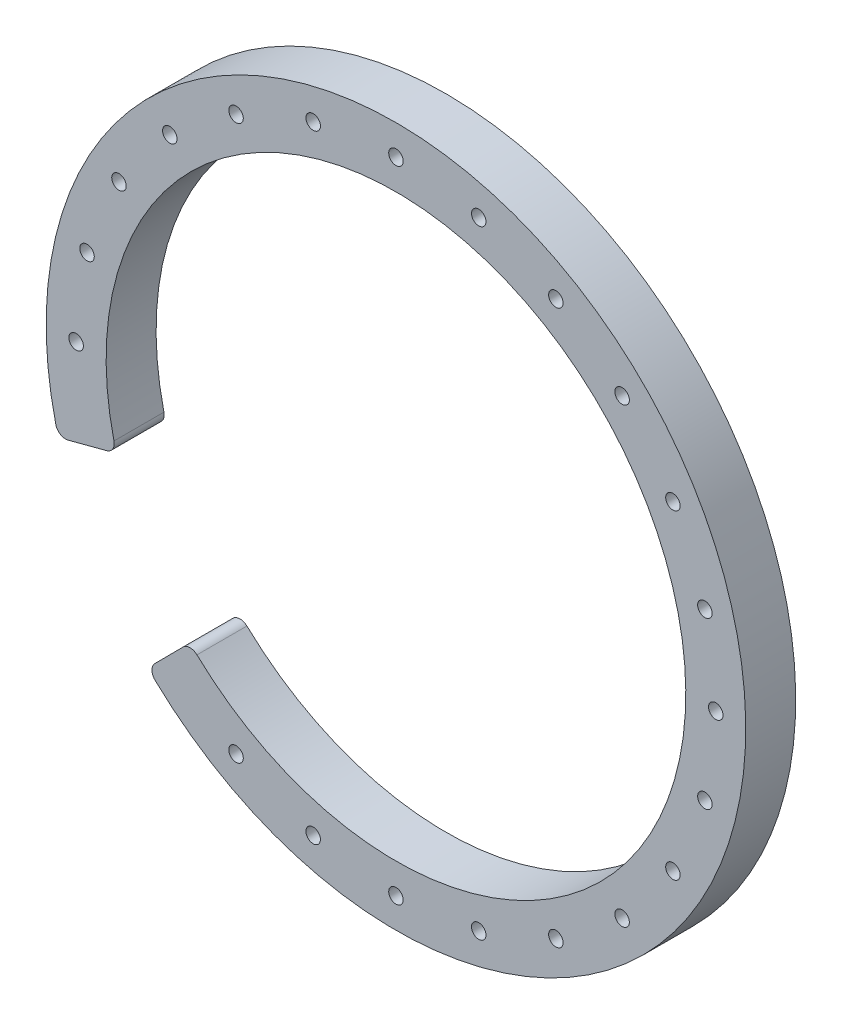
ISO-10303-21;
HEADER;
FILE_DESCRIPTION(('STEP AP214'),'2;1');
FILE_NAME('part.step','',(''),(''),'','','');
FILE_SCHEMA(('AUTOMOTIVE_DESIGN { 1 0 10303 214 1 1 1 1 }'));
ENDSEC;
DATA;
#1=APPLICATION_CONTEXT('core data for automotive mechanical design processes');
#2=APPLICATION_PROTOCOL_DEFINITION('international standard','automotive_design',2000,#1);
#3=PRODUCT_CONTEXT('',#1,'mechanical');
#4=PRODUCT('Part','Part','',(#3));
#5=PRODUCT_RELATED_PRODUCT_CATEGORY('part','',(#4));
#6=PRODUCT_DEFINITION_FORMATION('','',#4);
#7=PRODUCT_DEFINITION_CONTEXT('part definition',#1,'design');
#8=PRODUCT_DEFINITION('design','',#6,#7);
#9=PRODUCT_DEFINITION_SHAPE('','',#8);
#10=(LENGTH_UNIT() NAMED_UNIT(*) SI_UNIT(.MILLI.,.METRE.));
#11=(NAMED_UNIT(*) PLANE_ANGLE_UNIT() SI_UNIT($,.RADIAN.));
#12=(NAMED_UNIT(*) SI_UNIT($,.STERADIAN.) SOLID_ANGLE_UNIT());
#13=UNCERTAINTY_MEASURE_WITH_UNIT(LENGTH_MEASURE(1.E-05),#10,'distance_accuracy_value','');
#14=(GEOMETRIC_REPRESENTATION_CONTEXT(3) GLOBAL_UNCERTAINTY_ASSIGNED_CONTEXT((#13)) GLOBAL_UNIT_ASSIGNED_CONTEXT((#10,
#11,#12)) REPRESENTATION_CONTEXT('',''));
#15=CARTESIAN_POINT('',(0.,0.,0.));
#16=DIRECTION('',(0.,0.,1.));
#17=DIRECTION('',(1.,0.,0.));
#18=AXIS2_PLACEMENT_3D('',#15,#16,#17);
#19=CARTESIAN_POINT('',(-21.4655217337208,0.301986573379911,10.));
#20=DIRECTION('',(0.,0.,-1.));
#21=DIRECTION('',(-1.,0.,0.));
#22=AXIS2_PLACEMENT_3D('',#19,#20,#21);
#23=PLANE('',#22);
#24=CARTESIAN_POINT('',(106.466365988527,32.7761356443503,10.));
#25=DIRECTION('',(0.,0.,1.));
#26=DIRECTION('',(1.,0.,0.));
#27=AXIS2_PLACEMENT_3D('',#24,#25,#26);
#28=CIRCLE('',#27,1.45000000068001);
#29=CARTESIAN_POINT('',(107.916365989207,32.7761356443503,10.));
#30=VERTEX_POINT('',#29);
#31=EDGE_CURVE('E290',#30,#30,#28,.T.);
#32=ORIENTED_EDGE('',*,*,#31,.F.);
#33=EDGE_LOOP('',(#32));
#34=FACE_BOUND('',#33,.T.);
#35=CARTESIAN_POINT('',(89.9019471021725,61.466550752391,10.));
#36=DIRECTION('',(0.,0.,1.));
#37=DIRECTION('',(1.,0.,0.));
#38=AXIS2_PLACEMENT_3D('',#35,#36,#37);
#39=CIRCLE('',#38,1.45000000068001);
#40=CARTESIAN_POINT('',(91.3519471028525,61.466550752391,10.));
#41=VERTEX_POINT('',#40);
#42=EDGE_CURVE('E278',#41,#41,#39,.T.);
#43=ORIENTED_EDGE('',*,*,#42,.F.);
#44=EDGE_LOOP('',(#43));
#45=FACE_BOUND('',#44,.T.);
#46=CARTESIAN_POINT('',(61.2115319920066,78.0309696390124,10.));
#47=DIRECTION('',(0.,0.,1.));
#48=DIRECTION('',(1.,0.,0.));
#49=AXIS2_PLACEMENT_3D('',#46,#47,#48);
#50=CIRCLE('',#49,1.45000000068002);
#51=CARTESIAN_POINT('',(62.6615319926866,78.0309696390124,10.));
#52=VERTEX_POINT('',#51);
#53=EDGE_CURVE('E266',#52,#52,#50,.T.);
#54=ORIENTED_EDGE('',*,*,#53,.F.);
#55=EDGE_LOOP('',(#54));
#56=FACE_BOUND('',#55,.T.);
#57=CARTESIAN_POINT('',(28.0826942196036,78.0309696386723,10.));
#58=DIRECTION('',(0.,0.,1.));
#59=DIRECTION('',(1.,0.,0.));
#60=AXIS2_PLACEMENT_3D('',#57,#58,#59);
#61=CIRCLE('',#60,1.45000000067999);
#62=CARTESIAN_POINT('',(29.5326942202836,78.0309696386723,10.));
#63=VERTEX_POINT('',#62);
#64=EDGE_CURVE('E254',#63,#63,#61,.T.);
#65=ORIENTED_EDGE('',*,*,#64,.F.);
#66=EDGE_LOOP('',(#65));
#67=FACE_BOUND('',#66,.T.);
#68=CARTESIAN_POINT('',(-0.607720888874778,61.4665507528091,10.));
#69=DIRECTION('',(0.,0.,1.));
#70=DIRECTION('',(1.,0.,0.));
#71=AXIS2_PLACEMENT_3D('',#68,#69,#70);
#72=CIRCLE('',#71,1.45000000067999);
#73=CARTESIAN_POINT('',(0.842279111805213,61.4665507528091,10.));
#74=VERTEX_POINT('',#73);
#75=EDGE_CURVE('E242',#74,#74,#72,.T.);
#76=ORIENTED_EDGE('',*,*,#75,.F.);
#77=EDGE_LOOP('',(#76));
#78=FACE_BOUND('',#77,.T.);
#79=CARTESIAN_POINT('',(28.082694218639,-45.6075361259227,10.));
#80=DIRECTION('',(0.,0.,1.));
#81=DIRECTION('',(1.,0.,0.));
#82=AXIS2_PLACEMENT_3D('',#79,#80,#81);
#83=CIRCLE('',#82,1.45000000067999);
#84=CARTESIAN_POINT('',(29.532694219319,-45.6075361259227,10.));
#85=VERTEX_POINT('',#84);
#86=EDGE_CURVE('E230',#85,#85,#83,.T.);
#87=ORIENTED_EDGE('',*,*,#86,.F.);
#88=EDGE_LOOP('',(#87));
#89=FACE_BOUND('',#88,.T.);
#90=CARTESIAN_POINT('',(61.2115319929712,-45.6075361262628,10.));
#91=DIRECTION('',(0.,0.,1.));
#92=DIRECTION('',(1.,0.,0.));
#93=AXIS2_PLACEMENT_3D('',#90,#91,#92);
#94=CIRCLE('',#93,1.45000000068001);
#95=CARTESIAN_POINT('',(62.6615319936513,-45.6075361262628,10.));
#96=VERTEX_POINT('',#95);
#97=EDGE_CURVE('E218',#96,#96,#94,.T.);
#98=ORIENTED_EDGE('',*,*,#97,.F.);
#99=EDGE_LOOP('',(#98));
#100=FACE_BOUND('',#99,.T.);
#101=CARTESIAN_POINT('',(89.9019471041017,-29.0431172379706,10.));
#102=DIRECTION('',(0.,0.,1.));
#103=DIRECTION('',(1.,0.,0.));
#104=AXIS2_PLACEMENT_3D('',#101,#102,#103);
#105=CIRCLE('',#104,1.45000000068001);
#106=CARTESIAN_POINT('',(91.3519471047817,-29.0431172379706,10.));
#107=VERTEX_POINT('',#106);
#108=EDGE_CURVE('E206',#107,#107,#105,.T.);
#109=ORIENTED_EDGE('',*,*,#108,.F.);
#110=EDGE_LOOP('',(#109));
#111=FACE_BOUND('',#110,.T.);
#112=CARTESIAN_POINT('',(106.466365989491,-0.352702128259125,10.));
#113=DIRECTION('',(0.,0.,1.));
#114=DIRECTION('',(1.,0.,0.));
#115=AXIS2_PLACEMENT_3D('',#112,#113,#114);
#116=CIRCLE('',#115,1.45000000068001);
#117=CARTESIAN_POINT('',(107.916365990171,-0.352702128259125,10.));
#118=VERTEX_POINT('',#117);
#119=EDGE_CURVE('E194',#118,#118,#116,.T.);
#120=ORIENTED_EDGE('',*,*,#119,.F.);
#121=EDGE_LOOP('',(#120));
#122=FACE_BOUND('',#121,.T.);
#123=CARTESIAN_POINT('',(-10.7785127349104,48.2117167577246,10.));
#124=DIRECTION('',(0.,0.,1.));
#125=DIRECTION('',(1.,0.,0.));
#126=AXIS2_PLACEMENT_3D('',#123,#124,#125);
#127=CIRCLE('',#126,1.45000000067999);
#128=CARTESIAN_POINT('',(-9.32851273423041,48.2117167577246,10.));
#129=VERTEX_POINT('',#128);
#130=EDGE_CURVE('E182',#129,#129,#127,.T.);
#131=ORIENTED_EDGE('',*,*,#130,.F.);
#132=EDGE_LOOP('',(#131));
#133=FACE_BOUND('',#132,.T.);
#134=CARTESIAN_POINT('',(-21.4655217337208,0.301986573379911,10.));
#135=DIRECTION('',(0.,0.,1.));
#136=DIRECTION('',(-1.,0.,0.));
#137=AXIS2_PLACEMENT_3D('',#134,#135,#136);
#138=CIRCLE('',#137,2.);
#139=CARTESIAN_POINT('',(-23.4100109937255,-0.165946667292641,10.));
#140=VERTEX_POINT('',#139);
#141=CARTESIAN_POINT('',(-20.9549615565254,-1.63174771691497,10.));
#142=VERTEX_POINT('',#141);
#143=EDGE_CURVE('E145',#140,#142,#138,.T.);
#144=ORIENTED_EDGE('',*,*,#143,.T.);
#145=DIRECTION('',(0.966867145147441,0.255280088597674,0.));
#146=VECTOR('',#145,1.);
#147=CARTESIAN_POINT('',(-17.1055653612271,-0.615398979950219,10.));
#148=LINE('',#147,#146);
#149=CARTESIAN_POINT('',(-13.2179059297805,0.411052326289917,10.));
#150=VERTEX_POINT('',#149);
#151=EDGE_CURVE('E93',#142,#150,#148,.T.);
#152=ORIENTED_EDGE('',*,*,#151,.T.);
#153=CARTESIAN_POINT('',(-13.7284661069758,2.3447866165848,10.));
#154=DIRECTION('',(0.,0.,1.));
#155=DIRECTION('',(-1.,0.,0.));
#156=AXIS2_PLACEMENT_3D('',#153,#154,#155);
#157=CIRCLE('',#156,2.);
#158=CARTESIAN_POINT('',(-11.7826134665287,2.80701762124016,10.));
#159=VERTEX_POINT('',#158);
#160=EDGE_CURVE('E160',#150,#159,#157,.T.);
#161=ORIENTED_EDGE('',*,*,#160,.T.);
#162=CARTESIAN_POINT('',(44.6471131064398,16.2117167562456,10.));
#163=DIRECTION('',(0.,0.,-1.));
#164=DIRECTION('',(1.,0.,0.));
#165=AXIS2_PLACEMENT_3D('',#162,#163,#164);
#166=CIRCLE('',#165,58.);
#167=CARTESIAN_POINT('',(4.82343983769334,-25.955510415862,10.));
#168=VERTEX_POINT('',#167);
#169=EDGE_CURVE('E173',#159,#168,#166,.T.);
#170=ORIENTED_EDGE('',*,*,#169,.T.);
#171=CARTESIAN_POINT('',(3.45020972497796,-27.4095527321416,10.));
#172=DIRECTION('',(0.,0.,1.));
#173=DIRECTION('',(1.,0.,0.));
#174=AXIS2_PLACEMENT_3D('',#171,#172,#173);
#175=CIRCLE('',#174,2.);
#176=CARTESIAN_POINT('',(2.0308267940533,-26.0005275033398,10.));
#177=VERTEX_POINT('',#176);
#178=EDGE_CURVE('E112',#168,#177,#175,.T.);
#179=ORIENTED_EDGE('',*,*,#178,.T.);
#180=DIRECTION('',(-0.704512614400858,-0.709691465462329,0.));
#181=VECTOR('',#180,1.);
#182=CARTESIAN_POINT('',(2.0308267940533,-26.0005275033398,10.));
#183=LINE('',#182,#181);
#184=CARTESIAN_POINT('',(-3.60681775175627,-31.6796142048234,10.));
#185=VERTEX_POINT('',#184);
#186=EDGE_CURVE('E106',#177,#185,#183,.T.);
#187=ORIENTED_EDGE('',*,*,#186,.T.);
#188=CARTESIAN_POINT('',(-2.18743482083161,-33.0886394336251,10.));
#189=DIRECTION('',(0.,0.,1.));
#190=DIRECTION('',(1.,0.,0.));
#191=AXIS2_PLACEMENT_3D('',#188,#189,#190);
#192=CIRCLE('',#191,2.);
#193=CARTESIAN_POINT('',(-3.56492152457489,-34.5386499097977,10.));
#194=VERTEX_POINT('',#193);
#195=EDGE_CURVE('E110',#185,#194,#192,.T.);
#196=ORIENTED_EDGE('',*,*,#195,.T.);
#197=CARTESIAN_POINT('',(44.6471131064398,16.2117167562456,10.));
#198=DIRECTION('',(0.,0.,1.));
#199=DIRECTION('',(1.,0.,0.));
#200=AXIS2_PLACEMENT_3D('',#197,#198,#199);
#201=CIRCLE('',#200,70.);
#202=EDGE_CURVE('E50',#194,#140,#201,.T.);
#203=ORIENTED_EDGE('',*,*,#202,.T.);
#204=EDGE_LOOP('',(#144,#152,#161,#170,#179,#187,#196,#203));
#205=FACE_BOUND('',#204,.T.);
#206=CARTESIAN_POINT('',(-17.172139775591,32.7761356445594,10.));
#207=DIRECTION('',(0.,0.,1.));
#208=DIRECTION('',(1.,0.,0.));
#209=AXIS2_PLACEMENT_3D('',#206,#207,#208);
#210=CIRCLE('',#209,1.45000000067999);
#211=CARTESIAN_POINT('',(-15.722139774911,32.7761356445594,10.));
#212=VERTEX_POINT('',#211);
#213=EDGE_CURVE('E133',#212,#212,#210,.T.);
#214=ORIENTED_EDGE('',*,*,#213,.F.);
#215=EDGE_LOOP('',(#214));
#216=FACE_BOUND('',#215,.T.);
#217=CARTESIAN_POINT('',(-19.3528868935602,16.2117167581749,10.));
#218=DIRECTION('',(0.,0.,1.));
#219=DIRECTION('',(1.,0.,0.));
#220=AXIS2_PLACEMENT_3D('',#217,#218,#219);
#221=CIRCLE('',#220,1.45000000067999);
#222=CARTESIAN_POINT('',(-17.9028868928802,16.2117167581749,10.));
#223=VERTEX_POINT('',#222);
#224=EDGE_CURVE('E188',#223,#223,#221,.T.);
#225=ORIENTED_EDGE('',*,*,#224,.F.);
#226=EDGE_LOOP('',(#225));
#227=FACE_BOUND('',#226,.T.);
#228=CARTESIAN_POINT('',(100.07273894967,-15.7882832419774,10.));
#229=DIRECTION('',(0.,0.,1.));
#230=DIRECTION('',(1.,0.,0.));
#231=AXIS2_PLACEMENT_3D('',#228,#229,#230);
#232=CIRCLE('',#231,1.45000000068001);
#233=CARTESIAN_POINT('',(101.52273895035,-15.7882832419774,10.));
#234=VERTEX_POINT('',#233);
#235=EDGE_CURVE('E200',#234,#234,#232,.T.);
#236=ORIENTED_EDGE('',*,*,#235,.F.);
#237=EDGE_LOOP('',(#236));
#238=FACE_BOUND('',#237,.T.);
#239=CARTESIAN_POINT('',(76.6471131070915,-39.2139090855822,10.));
#240=DIRECTION('',(0.,0.,1.));
#241=DIRECTION('',(1.,0.,0.));
#242=AXIS2_PLACEMENT_3D('',#239,#240,#241);
#243=CIRCLE('',#242,1.45000000068001);
#244=CARTESIAN_POINT('',(78.0971131077715,-39.2139090855822,10.));
#245=VERTEX_POINT('',#244);
#246=EDGE_CURVE('E212',#245,#245,#243,.T.);
#247=ORIENTED_EDGE('',*,*,#246,.F.);
#248=EDGE_LOOP('',(#247));
#249=FACE_BOUND('',#248,.T.);
#250=CARTESIAN_POINT('',(44.6471131057595,-47.7882832437544,10.));
#251=DIRECTION('',(0.,0.,1.));
#252=DIRECTION('',(1.,0.,0.));
#253=AXIS2_PLACEMENT_3D('',#250,#251,#252);
#254=CIRCLE('',#253,1.45000000068002);
#255=CARTESIAN_POINT('',(46.0971131064395,-47.7882832437544,10.));
#256=VERTEX_POINT('',#255);
#257=EDGE_CURVE('E224',#256,#256,#254,.T.);
#258=ORIENTED_EDGE('',*,*,#257,.F.);
#259=EDGE_LOOP('',(#258));
#260=FACE_BOUND('',#259,.T.);
#261=CARTESIAN_POINT('',(12.6471131064152,-39.2139090859443,10.));
#262=DIRECTION('',(0.,0.,1.));
#263=DIRECTION('',(1.,0.,0.));
#264=AXIS2_PLACEMENT_3D('',#261,#262,#263);
#265=CIRCLE('',#264,1.45000000067999);
#266=CARTESIAN_POINT('',(14.0971131070952,-39.2139090859443,10.));
#267=VERTEX_POINT('',#266);
#268=EDGE_CURVE('E236',#267,#267,#265,.T.);
#269=ORIENTED_EDGE('',*,*,#268,.F.);
#270=EDGE_LOOP('',(#269));
#271=FACE_BOUND('',#270,.T.);
#272=CARTESIAN_POINT('',(12.647113108086,71.6373425994001,10.));
#273=DIRECTION('',(0.,0.,1.));
#274=DIRECTION('',(1.,0.,0.));
#275=AXIS2_PLACEMENT_3D('',#272,#273,#274);
#276=CIRCLE('',#275,1.45000000067999);
#277=CARTESIAN_POINT('',(14.097113108766,71.6373425994001,10.));
#278=VERTEX_POINT('',#277);
#279=EDGE_CURVE('E248',#278,#278,#276,.T.);
#280=ORIENTED_EDGE('',*,*,#279,.F.);
#281=EDGE_LOOP('',(#280));
#282=FACE_BOUND('',#281,.T.);
#283=CARTESIAN_POINT('',(44.6471131057595,80.2117167562456,10.));
#284=DIRECTION('',(0.,0.,1.));
#285=DIRECTION('',(1.,0.,0.));
#286=AXIS2_PLACEMENT_3D('',#283,#284,#285);
#287=CIRCLE('',#286,1.45000000068002);
#288=CARTESIAN_POINT('',(46.0971131064395,80.2117167562456,10.));
#289=VERTEX_POINT('',#288);
#290=EDGE_CURVE('E260',#289,#289,#287,.T.);
#291=ORIENTED_EDGE('',*,*,#290,.F.);
#292=EDGE_LOOP('',(#291));
#293=FACE_BOUND('',#292,.T.);
#294=CARTESIAN_POINT('',(76.6471131054207,71.637342599038,10.));
#295=DIRECTION('',(0.,0.,1.));
#296=DIRECTION('',(1.,0.,0.));
#297=AXIS2_PLACEMENT_3D('',#294,#295,#296);
#298=CIRCLE('',#297,1.45000000068001);
#299=CARTESIAN_POINT('',(78.0971131061007,71.637342599038,10.));
#300=VERTEX_POINT('',#299);
#301=EDGE_CURVE('E272',#300,#300,#298,.T.);
#302=ORIENTED_EDGE('',*,*,#301,.F.);
#303=EDGE_LOOP('',(#302));
#304=FACE_BOUND('',#303,.T.);
#305=CARTESIAN_POINT('',(100.072738947999,48.2117167573625,10.));
#306=DIRECTION('',(0.,0.,1.));
#307=DIRECTION('',(1.,0.,0.));
#308=AXIS2_PLACEMENT_3D('',#305,#306,#307);
#309=CIRCLE('',#308,1.45000000068001);
#310=CARTESIAN_POINT('',(101.522738948679,48.2117167573625,10.));
#311=VERTEX_POINT('',#310);
#312=EDGE_CURVE('E284',#311,#311,#309,.T.);
#313=ORIENTED_EDGE('',*,*,#312,.F.);
#314=EDGE_LOOP('',(#313));
#315=FACE_BOUND('',#314,.T.);
#316=CARTESIAN_POINT('',(108.64711310644,16.2117167581749,10.));
#317=DIRECTION('',(0.,0.,1.));
#318=DIRECTION('',(1.,0.,0.));
#319=AXIS2_PLACEMENT_3D('',#316,#317,#318);
#320=CIRCLE('',#319,1.45000000067997);
#321=CARTESIAN_POINT('',(110.09711310712,16.2117167581749,10.));
#322=VERTEX_POINT('',#321);
#323=EDGE_CURVE('E296',#322,#322,#320,.T.);
#324=ORIENTED_EDGE('',*,*,#323,.F.);
#325=EDGE_LOOP('',(#324));
#326=FACE_BOUND('',#325,.T.);
#327=ADVANCED_FACE('F33',(#34,#45,#56,#67,#78,#89,#100,#111,#122,#133,#205,#216,#227,#238,#249,
#260,#271,#282,#293,#304,#315,#326),#23,.F.);
#328=CARTESIAN_POINT('',(-21.4655217337208,0.301986573379911,0.));
#329=DIRECTION('',(0.,0.,-1.));
#330=DIRECTION('',(-1.,0.,0.));
#331=AXIS2_PLACEMENT_3D('',#328,#329,#330);
#332=PLANE('',#331);
#333=CARTESIAN_POINT('',(106.466365988527,32.7761356443503,0.));
#334=DIRECTION('',(0.,0.,1.));
#335=DIRECTION('',(1.,0.,0.));
#336=AXIS2_PLACEMENT_3D('',#333,#334,#335);
#337=CIRCLE('',#336,1.45000000068001);
#338=CARTESIAN_POINT('',(107.916365989207,32.7761356443503,0.));
#339=VERTEX_POINT('',#338);
#340=EDGE_CURVE('E293',#339,#339,#337,.T.);
#341=ORIENTED_EDGE('',*,*,#340,.T.);
#342=EDGE_LOOP('',(#341));
#343=FACE_BOUND('',#342,.T.);
#344=CARTESIAN_POINT('',(89.9019471021725,61.466550752391,0.));
#345=DIRECTION('',(0.,0.,1.));
#346=DIRECTION('',(1.,0.,0.));
#347=AXIS2_PLACEMENT_3D('',#344,#345,#346);
#348=CIRCLE('',#347,1.45000000068001);
#349=CARTESIAN_POINT('',(91.3519471028525,61.466550752391,0.));
#350=VERTEX_POINT('',#349);
#351=EDGE_CURVE('E281',#350,#350,#348,.T.);
#352=ORIENTED_EDGE('',*,*,#351,.T.);
#353=EDGE_LOOP('',(#352));
#354=FACE_BOUND('',#353,.T.);
#355=CARTESIAN_POINT('',(61.2115319920066,78.0309696390124,0.));
#356=DIRECTION('',(0.,0.,1.));
#357=DIRECTION('',(1.,0.,0.));
#358=AXIS2_PLACEMENT_3D('',#355,#356,#357);
#359=CIRCLE('',#358,1.45000000068002);
#360=CARTESIAN_POINT('',(62.6615319926866,78.0309696390124,0.));
#361=VERTEX_POINT('',#360);
#362=EDGE_CURVE('E269',#361,#361,#359,.T.);
#363=ORIENTED_EDGE('',*,*,#362,.T.);
#364=EDGE_LOOP('',(#363));
#365=FACE_BOUND('',#364,.T.);
#366=CARTESIAN_POINT('',(28.0826942196036,78.0309696386723,0.));
#367=DIRECTION('',(0.,0.,1.));
#368=DIRECTION('',(1.,0.,0.));
#369=AXIS2_PLACEMENT_3D('',#366,#367,#368);
#370=CIRCLE('',#369,1.45000000067999);
#371=CARTESIAN_POINT('',(29.5326942202836,78.0309696386723,0.));
#372=VERTEX_POINT('',#371);
#373=EDGE_CURVE('E257',#372,#372,#370,.T.);
#374=ORIENTED_EDGE('',*,*,#373,.T.);
#375=EDGE_LOOP('',(#374));
#376=FACE_BOUND('',#375,.T.);
#377=CARTESIAN_POINT('',(-0.607720888874778,61.4665507528091,0.));
#378=DIRECTION('',(0.,0.,1.));
#379=DIRECTION('',(1.,0.,0.));
#380=AXIS2_PLACEMENT_3D('',#377,#378,#379);
#381=CIRCLE('',#380,1.45000000067999);
#382=CARTESIAN_POINT('',(0.842279111805213,61.4665507528091,0.));
#383=VERTEX_POINT('',#382);
#384=EDGE_CURVE('E245',#383,#383,#381,.T.);
#385=ORIENTED_EDGE('',*,*,#384,.T.);
#386=EDGE_LOOP('',(#385));
#387=FACE_BOUND('',#386,.T.);
#388=CARTESIAN_POINT('',(28.082694218639,-45.6075361259227,0.));
#389=DIRECTION('',(0.,0.,1.));
#390=DIRECTION('',(1.,0.,0.));
#391=AXIS2_PLACEMENT_3D('',#388,#389,#390);
#392=CIRCLE('',#391,1.45000000067999);
#393=CARTESIAN_POINT('',(29.532694219319,-45.6075361259227,0.));
#394=VERTEX_POINT('',#393);
#395=EDGE_CURVE('E233',#394,#394,#392,.T.);
#396=ORIENTED_EDGE('',*,*,#395,.T.);
#397=EDGE_LOOP('',(#396));
#398=FACE_BOUND('',#397,.T.);
#399=CARTESIAN_POINT('',(61.2115319929712,-45.6075361262628,0.));
#400=DIRECTION('',(0.,0.,1.));
#401=DIRECTION('',(1.,0.,0.));
#402=AXIS2_PLACEMENT_3D('',#399,#400,#401);
#403=CIRCLE('',#402,1.45000000068001);
#404=CARTESIAN_POINT('',(62.6615319936513,-45.6075361262628,0.));
#405=VERTEX_POINT('',#404);
#406=EDGE_CURVE('E221',#405,#405,#403,.T.);
#407=ORIENTED_EDGE('',*,*,#406,.T.);
#408=EDGE_LOOP('',(#407));
#409=FACE_BOUND('',#408,.T.);
#410=CARTESIAN_POINT('',(89.9019471041017,-29.0431172379706,0.));
#411=DIRECTION('',(0.,0.,1.));
#412=DIRECTION('',(1.,0.,0.));
#413=AXIS2_PLACEMENT_3D('',#410,#411,#412);
#414=CIRCLE('',#413,1.45000000068001);
#415=CARTESIAN_POINT('',(91.3519471047817,-29.0431172379706,0.));
#416=VERTEX_POINT('',#415);
#417=EDGE_CURVE('E209',#416,#416,#414,.T.);
#418=ORIENTED_EDGE('',*,*,#417,.T.);
#419=EDGE_LOOP('',(#418));
#420=FACE_BOUND('',#419,.T.);
#421=CARTESIAN_POINT('',(106.466365989491,-0.352702128259125,0.));
#422=DIRECTION('',(0.,0.,1.));
#423=DIRECTION('',(1.,0.,0.));
#424=AXIS2_PLACEMENT_3D('',#421,#422,#423);
#425=CIRCLE('',#424,1.45000000068001);
#426=CARTESIAN_POINT('',(107.916365990171,-0.352702128259125,0.));
#427=VERTEX_POINT('',#426);
#428=EDGE_CURVE('E197',#427,#427,#425,.T.);
#429=ORIENTED_EDGE('',*,*,#428,.T.);
#430=EDGE_LOOP('',(#429));
#431=FACE_BOUND('',#430,.T.);
#432=CARTESIAN_POINT('',(-10.7785127349104,48.2117167577246,0.));
#433=DIRECTION('',(0.,0.,1.));
#434=DIRECTION('',(1.,0.,0.));
#435=AXIS2_PLACEMENT_3D('',#432,#433,#434);
#436=CIRCLE('',#435,1.45000000067999);
#437=CARTESIAN_POINT('',(-9.32851273423041,48.2117167577246,0.));
#438=VERTEX_POINT('',#437);
#439=EDGE_CURVE('E185',#438,#438,#436,.T.);
#440=ORIENTED_EDGE('',*,*,#439,.T.);
#441=EDGE_LOOP('',(#440));
#442=FACE_BOUND('',#441,.T.);
#443=CARTESIAN_POINT('',(-21.4655217337208,0.301986573379911,0.));
#444=DIRECTION('',(0.,0.,1.));
#445=DIRECTION('',(-1.,0.,0.));
#446=AXIS2_PLACEMENT_3D('',#443,#444,#445);
#447=CIRCLE('',#446,2.);
#448=CARTESIAN_POINT('',(-23.4100109937255,-0.165946667292641,0.));
#449=VERTEX_POINT('',#448);
#450=CARTESIAN_POINT('',(-20.9549615565254,-1.63174771691497,0.));
#451=VERTEX_POINT('',#450);
#452=EDGE_CURVE('E129',#449,#451,#447,.T.);
#453=ORIENTED_EDGE('',*,*,#452,.F.);
#454=CARTESIAN_POINT('',(44.6471131064398,16.2117167562456,0.));
#455=DIRECTION('',(0.,0.,1.));
#456=DIRECTION('',(1.,0.,0.));
#457=AXIS2_PLACEMENT_3D('',#454,#455,#456);
#458=CIRCLE('',#457,70.);
#459=CARTESIAN_POINT('',(-3.56492152457489,-34.5386499097977,0.));
#460=VERTEX_POINT('',#459);
#461=EDGE_CURVE('E85',#460,#449,#458,.T.);
#462=ORIENTED_EDGE('',*,*,#461,.F.);
#463=CARTESIAN_POINT('',(-2.18743482083161,-33.0886394336251,0.));
#464=DIRECTION('',(0.,0.,1.));
#465=DIRECTION('',(1.,0.,0.));
#466=AXIS2_PLACEMENT_3D('',#463,#464,#465);
#467=CIRCLE('',#466,2.);
#468=CARTESIAN_POINT('',(-3.60681775175627,-31.6796142048234,0.));
#469=VERTEX_POINT('',#468);
#470=EDGE_CURVE('E79',#469,#460,#467,.T.);
#471=ORIENTED_EDGE('',*,*,#470,.F.);
#472=DIRECTION('',(-0.704512614400858,-0.709691465462329,0.));
#473=VECTOR('',#472,1.);
#474=CARTESIAN_POINT('',(-0.801935827680054,-28.8541136779956,0.));
#475=LINE('',#474,#473);
#476=CARTESIAN_POINT('',(2.0308267940533,-26.0005275033398,0.));
#477=VERTEX_POINT('',#476);
#478=EDGE_CURVE('E119',#477,#469,#475,.T.);
#479=ORIENTED_EDGE('',*,*,#478,.F.);
#480=CARTESIAN_POINT('',(3.45020972497796,-27.4095527321416,0.));
#481=DIRECTION('',(0.,0.,1.));
#482=DIRECTION('',(1.,0.,0.));
#483=AXIS2_PLACEMENT_3D('',#480,#481,#482);
#484=CIRCLE('',#483,2.);
#485=CARTESIAN_POINT('',(4.82343983769334,-25.955510415862,0.));
#486=VERTEX_POINT('',#485);
#487=EDGE_CURVE('E139',#486,#477,#484,.T.);
#488=ORIENTED_EDGE('',*,*,#487,.F.);
#489=CARTESIAN_POINT('',(44.6471131064398,16.2117167562456,0.));
#490=DIRECTION('',(0.,0.,-1.));
#491=DIRECTION('',(1.,0.,0.));
#492=AXIS2_PLACEMENT_3D('',#489,#490,#491);
#493=CIRCLE('',#492,58.);
#494=CARTESIAN_POINT('',(-11.7826134665287,2.80701762124016,0.));
#495=VERTEX_POINT('',#494);
#496=EDGE_CURVE('E137',#495,#486,#493,.T.);
#497=ORIENTED_EDGE('',*,*,#496,.F.);
#498=CARTESIAN_POINT('',(-13.7284661069758,2.3447866165848,0.));
#499=DIRECTION('',(0.,0.,1.));
#500=DIRECTION('',(-1.,0.,0.));
#501=AXIS2_PLACEMENT_3D('',#498,#499,#500);
#502=CIRCLE('',#501,2.);
#503=CARTESIAN_POINT('',(-13.2179059297805,0.411052326289917,0.));
#504=VERTEX_POINT('',#503);
#505=EDGE_CURVE('E135',#504,#495,#502,.T.);
#506=ORIENTED_EDGE('',*,*,#505,.F.);
#507=DIRECTION('',(0.966867145147441,0.255280088597674,0.));
#508=VECTOR('',#507,1.);
#509=CARTESIAN_POINT('',(-13.2179059297805,0.411052326289917,0.));
#510=LINE('',#509,#508);
#511=EDGE_CURVE('E132',#451,#504,#510,.T.);
#512=ORIENTED_EDGE('',*,*,#511,.F.);
#513=EDGE_LOOP('',(#453,#462,#471,#479,#488,#497,#506,#512));
#514=FACE_BOUND('',#513,.T.);
#515=CARTESIAN_POINT('',(-17.172139775591,32.7761356445594,0.));
#516=DIRECTION('',(0.,0.,1.));
#517=DIRECTION('',(1.,0.,0.));
#518=AXIS2_PLACEMENT_3D('',#515,#516,#517);
#519=CIRCLE('',#518,1.45000000067999);
#520=CARTESIAN_POINT('',(-15.722139774911,32.7761356445594,0.));
#521=VERTEX_POINT('',#520);
#522=EDGE_CURVE('E179',#521,#521,#519,.T.);
#523=ORIENTED_EDGE('',*,*,#522,.T.);
#524=EDGE_LOOP('',(#523));
#525=FACE_BOUND('',#524,.T.);
#526=CARTESIAN_POINT('',(-19.3528868935602,16.2117167581749,0.));
#527=DIRECTION('',(0.,0.,1.));
#528=DIRECTION('',(1.,0.,0.));
#529=AXIS2_PLACEMENT_3D('',#526,#527,#528);
#530=CIRCLE('',#529,1.45000000067999);
#531=CARTESIAN_POINT('',(-17.9028868928802,16.2117167581749,0.));
#532=VERTEX_POINT('',#531);
#533=EDGE_CURVE('E191',#532,#532,#530,.T.);
#534=ORIENTED_EDGE('',*,*,#533,.T.);
#535=EDGE_LOOP('',(#534));
#536=FACE_BOUND('',#535,.T.);
#537=CARTESIAN_POINT('',(100.07273894967,-15.7882832419774,0.));
#538=DIRECTION('',(0.,0.,1.));
#539=DIRECTION('',(1.,0.,0.));
#540=AXIS2_PLACEMENT_3D('',#537,#538,#539);
#541=CIRCLE('',#540,1.45000000068001);
#542=CARTESIAN_POINT('',(101.52273895035,-15.7882832419774,0.));
#543=VERTEX_POINT('',#542);
#544=EDGE_CURVE('E203',#543,#543,#541,.T.);
#545=ORIENTED_EDGE('',*,*,#544,.T.);
#546=EDGE_LOOP('',(#545));
#547=FACE_BOUND('',#546,.T.);
#548=CARTESIAN_POINT('',(76.6471131070915,-39.2139090855822,0.));
#549=DIRECTION('',(0.,0.,1.));
#550=DIRECTION('',(1.,0.,0.));
#551=AXIS2_PLACEMENT_3D('',#548,#549,#550);
#552=CIRCLE('',#551,1.45000000068001);
#553=CARTESIAN_POINT('',(78.0971131077715,-39.2139090855822,0.));
#554=VERTEX_POINT('',#553);
#555=EDGE_CURVE('E215',#554,#554,#552,.T.);
#556=ORIENTED_EDGE('',*,*,#555,.T.);
#557=EDGE_LOOP('',(#556));
#558=FACE_BOUND('',#557,.T.);
#559=CARTESIAN_POINT('',(44.6471131057595,-47.7882832437544,0.));
#560=DIRECTION('',(0.,0.,1.));
#561=DIRECTION('',(1.,0.,0.));
#562=AXIS2_PLACEMENT_3D('',#559,#560,#561);
#563=CIRCLE('',#562,1.45000000068002);
#564=CARTESIAN_POINT('',(46.0971131064395,-47.7882832437544,0.));
#565=VERTEX_POINT('',#564);
#566=EDGE_CURVE('E227',#565,#565,#563,.T.);
#567=ORIENTED_EDGE('',*,*,#566,.T.);
#568=EDGE_LOOP('',(#567));
#569=FACE_BOUND('',#568,.T.);
#570=CARTESIAN_POINT('',(12.6471131064152,-39.2139090859443,0.));
#571=DIRECTION('',(0.,0.,1.));
#572=DIRECTION('',(1.,0.,0.));
#573=AXIS2_PLACEMENT_3D('',#570,#571,#572);
#574=CIRCLE('',#573,1.45000000067999);
#575=CARTESIAN_POINT('',(14.0971131070952,-39.2139090859443,0.));
#576=VERTEX_POINT('',#575);
#577=EDGE_CURVE('E239',#576,#576,#574,.T.);
#578=ORIENTED_EDGE('',*,*,#577,.T.);
#579=EDGE_LOOP('',(#578));
#580=FACE_BOUND('',#579,.T.);
#581=CARTESIAN_POINT('',(12.647113108086,71.6373425994001,0.));
#582=DIRECTION('',(0.,0.,1.));
#583=DIRECTION('',(1.,0.,0.));
#584=AXIS2_PLACEMENT_3D('',#581,#582,#583);
#585=CIRCLE('',#584,1.45000000067999);
#586=CARTESIAN_POINT('',(14.097113108766,71.6373425994001,0.));
#587=VERTEX_POINT('',#586);
#588=EDGE_CURVE('E251',#587,#587,#585,.T.);
#589=ORIENTED_EDGE('',*,*,#588,.T.);
#590=EDGE_LOOP('',(#589));
#591=FACE_BOUND('',#590,.T.);
#592=CARTESIAN_POINT('',(44.6471131057595,80.2117167562456,0.));
#593=DIRECTION('',(0.,0.,1.));
#594=DIRECTION('',(1.,0.,0.));
#595=AXIS2_PLACEMENT_3D('',#592,#593,#594);
#596=CIRCLE('',#595,1.45000000068002);
#597=CARTESIAN_POINT('',(46.0971131064395,80.2117167562456,0.));
#598=VERTEX_POINT('',#597);
#599=EDGE_CURVE('E263',#598,#598,#596,.T.);
#600=ORIENTED_EDGE('',*,*,#599,.T.);
#601=EDGE_LOOP('',(#600));
#602=FACE_BOUND('',#601,.T.);
#603=CARTESIAN_POINT('',(76.6471131054207,71.637342599038,0.));
#604=DIRECTION('',(0.,0.,1.));
#605=DIRECTION('',(1.,0.,0.));
#606=AXIS2_PLACEMENT_3D('',#603,#604,#605);
#607=CIRCLE('',#606,1.45000000068001);
#608=CARTESIAN_POINT('',(78.0971131061007,71.637342599038,0.));
#609=VERTEX_POINT('',#608);
#610=EDGE_CURVE('E275',#609,#609,#607,.T.);
#611=ORIENTED_EDGE('',*,*,#610,.T.);
#612=EDGE_LOOP('',(#611));
#613=FACE_BOUND('',#612,.T.);
#614=CARTESIAN_POINT('',(100.072738947999,48.2117167573625,0.));
#615=DIRECTION('',(0.,0.,1.));
#616=DIRECTION('',(1.,0.,0.));
#617=AXIS2_PLACEMENT_3D('',#614,#615,#616);
#618=CIRCLE('',#617,1.45000000068001);
#619=CARTESIAN_POINT('',(101.522738948679,48.2117167573625,0.));
#620=VERTEX_POINT('',#619);
#621=EDGE_CURVE('E287',#620,#620,#618,.T.);
#622=ORIENTED_EDGE('',*,*,#621,.T.);
#623=EDGE_LOOP('',(#622));
#624=FACE_BOUND('',#623,.T.);
#625=CARTESIAN_POINT('',(108.64711310644,16.2117167581749,0.));
#626=DIRECTION('',(0.,0.,1.));
#627=DIRECTION('',(1.,0.,0.));
#628=AXIS2_PLACEMENT_3D('',#625,#626,#627);
#629=CIRCLE('',#628,1.45000000067997);
#630=CARTESIAN_POINT('',(110.09711310712,16.2117167581749,0.));
#631=VERTEX_POINT('',#630);
#632=EDGE_CURVE('E299',#631,#631,#629,.T.);
#633=ORIENTED_EDGE('',*,*,#632,.T.);
#634=EDGE_LOOP('',(#633));
#635=FACE_BOUND('',#634,.T.);
#636=ADVANCED_FACE('F164',(#343,#354,#365,#376,#387,#398,#409,#420,#431,#442,#514,#525,#536,
#547,#558,#569,#580,#591,#602,#613,#624,#635),#332,.T.);
#637=CARTESIAN_POINT('',(-21.4655217337208,0.301986573379911,10.));
#638=DIRECTION('',(0.,0.,-1.));
#639=DIRECTION('',(-1.,0.,0.));
#640=AXIS2_PLACEMENT_3D('',#637,#638,#639);
#641=CYLINDRICAL_SURFACE('',#640,2.);
#642=ORIENTED_EDGE('',*,*,#452,.T.);
#643=DIRECTION('',(0.,0.,-1.));
#644=VECTOR('',#643,1.);
#645=CARTESIAN_POINT('',(-20.9549615565254,-1.63174771691497,10.));
#646=LINE('',#645,#644);
#647=EDGE_CURVE('E11',#142,#451,#646,.T.);
#648=ORIENTED_EDGE('',*,*,#647,.F.);
#649=ORIENTED_EDGE('',*,*,#143,.F.);
#650=DIRECTION('',(0.,0.,-1.));
#651=VECTOR('',#650,1.);
#652=CARTESIAN_POINT('',(-23.4100109937255,-0.165946667292641,10.));
#653=LINE('',#652,#651);
#654=EDGE_CURVE('E125',#140,#449,#653,.T.);
#655=ORIENTED_EDGE('',*,*,#654,.T.);
#656=EDGE_LOOP('',(#642,#648,#649,#655));
#657=FACE_BOUND('',#656,.T.);
#658=ADVANCED_FACE('F35',(#657),#641,.T.);
#659=CARTESIAN_POINT('',(-13.2179059297805,0.411052326289917,10.));
#660=DIRECTION('',(-0.255280088597674,0.966867145147442,0.));
#661=DIRECTION('',(-0.966867145147442,-0.255280088597674,0.));
#662=AXIS2_PLACEMENT_3D('',#659,#660,#661);
#663=PLANE('',#662);
#664=ORIENTED_EDGE('',*,*,#511,.T.);
#665=DIRECTION('',(0.,0.,-1.));
#666=VECTOR('',#665,1.);
#667=CARTESIAN_POINT('',(-13.2179059297805,0.411052326289917,10.));
#668=LINE('',#667,#666);
#669=EDGE_CURVE('E42',#150,#504,#668,.T.);
#670=ORIENTED_EDGE('',*,*,#669,.F.);
#671=ORIENTED_EDGE('',*,*,#151,.F.);
#672=ORIENTED_EDGE('',*,*,#647,.T.);
#673=EDGE_LOOP('',(#664,#670,#671,#672));
#674=FACE_BOUND('',#673,.T.);
#675=ADVANCED_FACE('F334',(#674),#663,.F.);
#676=CARTESIAN_POINT('',(-13.7284661069758,2.3447866165848,10.));
#677=DIRECTION('',(0.,0.,-1.));
#678=DIRECTION('',(-1.,0.,0.));
#679=AXIS2_PLACEMENT_3D('',#676,#677,#678);
#680=CYLINDRICAL_SURFACE('',#679,2.);
#681=ORIENTED_EDGE('',*,*,#505,.T.);
#682=DIRECTION('',(0.,0.,-1.));
#683=VECTOR('',#682,1.);
#684=CARTESIAN_POINT('',(-11.7826134665287,2.80701762124016,10.));
#685=LINE('',#684,#683);
#686=EDGE_CURVE('E152',#159,#495,#685,.T.);
#687=ORIENTED_EDGE('',*,*,#686,.F.);
#688=ORIENTED_EDGE('',*,*,#160,.F.);
#689=ORIENTED_EDGE('',*,*,#669,.T.);
#690=EDGE_LOOP('',(#681,#687,#688,#689));
#691=FACE_BOUND('',#690,.T.);
#692=ADVANCED_FACE('F158',(#691),#680,.T.);
#693=CARTESIAN_POINT('',(44.6471131064398,16.2117167562456,10.));
#694=DIRECTION('',(0.,0.,-1.));
#695=DIRECTION('',(-1.,0.,0.));
#696=AXIS2_PLACEMENT_3D('',#693,#694,#695);
#697=CYLINDRICAL_SURFACE('',#696,58.);
#698=ORIENTED_EDGE('',*,*,#496,.T.);
#699=DIRECTION('',(0.,0.,-1.));
#700=VECTOR('',#699,1.);
#701=CARTESIAN_POINT('',(4.82343983769334,-25.955510415862,10.));
#702=LINE('',#701,#700);
#703=EDGE_CURVE('E149',#168,#486,#702,.T.);
#704=ORIENTED_EDGE('',*,*,#703,.F.);
#705=ORIENTED_EDGE('',*,*,#169,.F.);
#706=ORIENTED_EDGE('',*,*,#686,.T.);
#707=EDGE_LOOP('',(#698,#704,#705,#706));
#708=FACE_BOUND('',#707,.T.);
#709=ADVANCED_FACE('F169',(#708),#697,.F.);
#710=CARTESIAN_POINT('',(3.45020972497796,-27.4095527321416,10.));
#711=DIRECTION('',(0.,0.,-1.));
#712=DIRECTION('',(-1.,0.,0.));
#713=AXIS2_PLACEMENT_3D('',#710,#711,#712);
#714=CYLINDRICAL_SURFACE('',#713,2.);
#715=ORIENTED_EDGE('',*,*,#487,.T.);
#716=DIRECTION('',(0.,0.,-1.));
#717=VECTOR('',#716,1.);
#718=CARTESIAN_POINT('',(2.0308267940533,-26.0005275033398,10.));
#719=LINE('',#718,#717);
#720=EDGE_CURVE('E120',#177,#477,#719,.T.);
#721=ORIENTED_EDGE('',*,*,#720,.F.);
#722=ORIENTED_EDGE('',*,*,#178,.F.);
#723=ORIENTED_EDGE('',*,*,#703,.T.);
#724=EDGE_LOOP('',(#715,#721,#722,#723));
#725=FACE_BOUND('',#724,.T.);
#726=ADVANCED_FACE('F172',(#725),#714,.T.);
#727=CARTESIAN_POINT('',(-0.801935827680054,-28.8541136779956,10.));
#728=DIRECTION('',(0.709691465462329,-0.704512614400858,0.));
#729=DIRECTION('',(0.704512614400858,0.709691465462329,0.));
#730=AXIS2_PLACEMENT_3D('',#727,#728,#729);
#731=PLANE('',#730);
#732=ORIENTED_EDGE('',*,*,#478,.T.);
#733=DIRECTION('',(0.,0.,-1.));
#734=VECTOR('',#733,1.);
#735=CARTESIAN_POINT('',(-3.60681775175627,-31.6796142048234,10.));
#736=LINE('',#735,#734);
#737=EDGE_CURVE('E117',#185,#469,#736,.T.);
#738=ORIENTED_EDGE('',*,*,#737,.F.);
#739=ORIENTED_EDGE('',*,*,#186,.F.);
#740=ORIENTED_EDGE('',*,*,#720,.T.);
#741=EDGE_LOOP('',(#732,#738,#739,#740));
#742=FACE_BOUND('',#741,.T.);
#743=ADVANCED_FACE('F118',(#742),#731,.F.);
#744=CARTESIAN_POINT('',(-2.18743482083161,-33.0886394336251,10.));
#745=DIRECTION('',(0.,0.,-1.));
#746=DIRECTION('',(-1.,0.,0.));
#747=AXIS2_PLACEMENT_3D('',#744,#745,#746);
#748=CYLINDRICAL_SURFACE('',#747,2.);
#749=ORIENTED_EDGE('',*,*,#470,.T.);
#750=DIRECTION('',(0.,0.,-1.));
#751=VECTOR('',#750,1.);
#752=CARTESIAN_POINT('',(-3.56492152457489,-34.5386499097977,10.));
#753=LINE('',#752,#751);
#754=EDGE_CURVE('E121',#194,#460,#753,.T.);
#755=ORIENTED_EDGE('',*,*,#754,.F.);
#756=ORIENTED_EDGE('',*,*,#195,.F.);
#757=ORIENTED_EDGE('',*,*,#737,.T.);
#758=EDGE_LOOP('',(#749,#755,#756,#757));
#759=FACE_BOUND('',#758,.T.);
#760=ADVANCED_FACE('F123',(#759),#748,.T.);
#761=CARTESIAN_POINT('',(44.6471131064398,16.2117167562456,10.));
#762=DIRECTION('',(0.,0.,-1.));
#763=DIRECTION('',(-1.,0.,0.));
#764=AXIS2_PLACEMENT_3D('',#761,#762,#763);
#765=CYLINDRICAL_SURFACE('',#764,70.);
#766=ORIENTED_EDGE('',*,*,#461,.T.);
#767=ORIENTED_EDGE('',*,*,#654,.F.);
#768=ORIENTED_EDGE('',*,*,#202,.F.);
#769=ORIENTED_EDGE('',*,*,#754,.T.);
#770=EDGE_LOOP('',(#766,#767,#768,#769));
#771=FACE_BOUND('',#770,.T.);
#772=ADVANCED_FACE('F322',(#771),#765,.T.);
#773=CARTESIAN_POINT('',(-17.172139775591,32.7761356445594,10.));
#774=DIRECTION('',(0.,0.,-1.));
#775=DIRECTION('',(-1.,0.,0.));
#776=AXIS2_PLACEMENT_3D('',#773,#774,#775);
#777=CYLINDRICAL_SURFACE('',#776,1.45000000067999);
#778=ORIENTED_EDGE('',*,*,#213,.T.);
#779=EDGE_LOOP('',(#778));
#780=FACE_BOUND('',#779,.T.);
#781=ORIENTED_EDGE('',*,*,#522,.F.);
#782=EDGE_LOOP('',(#781));
#783=FACE_BOUND('',#782,.T.);
#784=ADVANCED_FACE('F319',(#780,#783),#777,.F.);
#785=CARTESIAN_POINT('',(-10.7785127349104,48.2117167577246,10.));
#786=DIRECTION('',(0.,0.,-1.));
#787=DIRECTION('',(-1.,0.,0.));
#788=AXIS2_PLACEMENT_3D('',#785,#786,#787);
#789=CYLINDRICAL_SURFACE('',#788,1.45000000067999);
#790=ORIENTED_EDGE('',*,*,#130,.T.);
#791=EDGE_LOOP('',(#790));
#792=FACE_BOUND('',#791,.T.);
#793=ORIENTED_EDGE('',*,*,#439,.F.);
#794=EDGE_LOOP('',(#793));
#795=FACE_BOUND('',#794,.T.);
#796=ADVANCED_FACE('F404',(#792,#795),#789,.F.);
#797=CARTESIAN_POINT('',(-19.3528868935602,16.2117167581749,10.));
#798=DIRECTION('',(0.,0.,-1.));
#799=DIRECTION('',(-1.,0.,0.));
#800=AXIS2_PLACEMENT_3D('',#797,#798,#799);
#801=CYLINDRICAL_SURFACE('',#800,1.45000000067999);
#802=ORIENTED_EDGE('',*,*,#224,.T.);
#803=EDGE_LOOP('',(#802));
#804=FACE_BOUND('',#803,.T.);
#805=ORIENTED_EDGE('',*,*,#533,.F.);
#806=EDGE_LOOP('',(#805));
#807=FACE_BOUND('',#806,.T.);
#808=ADVANCED_FACE('F412',(#804,#807),#801,.F.);
#809=CARTESIAN_POINT('',(106.466365989491,-0.352702128259125,10.));
#810=DIRECTION('',(0.,0.,-1.));
#811=DIRECTION('',(-1.,0.,0.));
#812=AXIS2_PLACEMENT_3D('',#809,#810,#811);
#813=CYLINDRICAL_SURFACE('',#812,1.45000000068001);
#814=ORIENTED_EDGE('',*,*,#119,.T.);
#815=EDGE_LOOP('',(#814));
#816=FACE_BOUND('',#815,.T.);
#817=ORIENTED_EDGE('',*,*,#428,.F.);
#818=EDGE_LOOP('',(#817));
#819=FACE_BOUND('',#818,.T.);
#820=ADVANCED_FACE('F420',(#816,#819),#813,.F.);
#821=CARTESIAN_POINT('',(100.07273894967,-15.7882832419774,10.));
#822=DIRECTION('',(0.,0.,-1.));
#823=DIRECTION('',(-1.,0.,0.));
#824=AXIS2_PLACEMENT_3D('',#821,#822,#823);
#825=CYLINDRICAL_SURFACE('',#824,1.45000000068001);
#826=ORIENTED_EDGE('',*,*,#235,.T.);
#827=EDGE_LOOP('',(#826));
#828=FACE_BOUND('',#827,.T.);
#829=ORIENTED_EDGE('',*,*,#544,.F.);
#830=EDGE_LOOP('',(#829));
#831=FACE_BOUND('',#830,.T.);
#832=ADVANCED_FACE('F429',(#828,#831),#825,.F.);
#833=CARTESIAN_POINT('',(89.9019471041017,-29.0431172379706,10.));
#834=DIRECTION('',(0.,0.,-1.));
#835=DIRECTION('',(-1.,0.,0.));
#836=AXIS2_PLACEMENT_3D('',#833,#834,#835);
#837=CYLINDRICAL_SURFACE('',#836,1.45000000068001);
#838=ORIENTED_EDGE('',*,*,#108,.T.);
#839=EDGE_LOOP('',(#838));
#840=FACE_BOUND('',#839,.T.);
#841=ORIENTED_EDGE('',*,*,#417,.F.);
#842=EDGE_LOOP('',(#841));
#843=FACE_BOUND('',#842,.T.);
#844=ADVANCED_FACE('F438',(#840,#843),#837,.F.);
#845=CARTESIAN_POINT('',(76.6471131070915,-39.2139090855822,10.));
#846=DIRECTION('',(0.,0.,-1.));
#847=DIRECTION('',(-1.,0.,0.));
#848=AXIS2_PLACEMENT_3D('',#845,#846,#847);
#849=CYLINDRICAL_SURFACE('',#848,1.45000000068001);
#850=ORIENTED_EDGE('',*,*,#246,.T.);
#851=EDGE_LOOP('',(#850));
#852=FACE_BOUND('',#851,.T.);
#853=ORIENTED_EDGE('',*,*,#555,.F.);
#854=EDGE_LOOP('',(#853));
#855=FACE_BOUND('',#854,.T.);
#856=ADVANCED_FACE('F447',(#852,#855),#849,.F.);
#857=CARTESIAN_POINT('',(61.2115319929712,-45.6075361262628,10.));
#858=DIRECTION('',(0.,0.,-1.));
#859=DIRECTION('',(-1.,0.,0.));
#860=AXIS2_PLACEMENT_3D('',#857,#858,#859);
#861=CYLINDRICAL_SURFACE('',#860,1.45000000068001);
#862=ORIENTED_EDGE('',*,*,#97,.T.);
#863=EDGE_LOOP('',(#862));
#864=FACE_BOUND('',#863,.T.);
#865=ORIENTED_EDGE('',*,*,#406,.F.);
#866=EDGE_LOOP('',(#865));
#867=FACE_BOUND('',#866,.T.);
#868=ADVANCED_FACE('F456',(#864,#867),#861,.F.);
#869=CARTESIAN_POINT('',(44.6471131057595,-47.7882832437544,10.));
#870=DIRECTION('',(0.,0.,-1.));
#871=DIRECTION('',(-1.,0.,0.));
#872=AXIS2_PLACEMENT_3D('',#869,#870,#871);
#873=CYLINDRICAL_SURFACE('',#872,1.45000000068002);
#874=ORIENTED_EDGE('',*,*,#257,.T.);
#875=EDGE_LOOP('',(#874));
#876=FACE_BOUND('',#875,.T.);
#877=ORIENTED_EDGE('',*,*,#566,.F.);
#878=EDGE_LOOP('',(#877));
#879=FACE_BOUND('',#878,.T.);
#880=ADVANCED_FACE('F465',(#876,#879),#873,.F.);
#881=CARTESIAN_POINT('',(28.082694218639,-45.6075361259227,10.));
#882=DIRECTION('',(0.,0.,-1.));
#883=DIRECTION('',(-1.,0.,0.));
#884=AXIS2_PLACEMENT_3D('',#881,#882,#883);
#885=CYLINDRICAL_SURFACE('',#884,1.45000000067999);
#886=ORIENTED_EDGE('',*,*,#86,.T.);
#887=EDGE_LOOP('',(#886));
#888=FACE_BOUND('',#887,.T.);
#889=ORIENTED_EDGE('',*,*,#395,.F.);
#890=EDGE_LOOP('',(#889));
#891=FACE_BOUND('',#890,.T.);
#892=ADVANCED_FACE('F474',(#888,#891),#885,.F.);
#893=CARTESIAN_POINT('',(12.6471131064152,-39.2139090859443,10.));
#894=DIRECTION('',(0.,0.,-1.));
#895=DIRECTION('',(-1.,0.,0.));
#896=AXIS2_PLACEMENT_3D('',#893,#894,#895);
#897=CYLINDRICAL_SURFACE('',#896,1.45000000067999);
#898=ORIENTED_EDGE('',*,*,#268,.T.);
#899=EDGE_LOOP('',(#898));
#900=FACE_BOUND('',#899,.T.);
#901=ORIENTED_EDGE('',*,*,#577,.F.);
#902=EDGE_LOOP('',(#901));
#903=FACE_BOUND('',#902,.T.);
#904=ADVANCED_FACE('F483',(#900,#903),#897,.F.);
#905=CARTESIAN_POINT('',(-0.607720888874778,61.4665507528091,10.));
#906=DIRECTION('',(0.,0.,-1.));
#907=DIRECTION('',(-1.,0.,0.));
#908=AXIS2_PLACEMENT_3D('',#905,#906,#907);
#909=CYLINDRICAL_SURFACE('',#908,1.45000000067999);
#910=ORIENTED_EDGE('',*,*,#75,.T.);
#911=EDGE_LOOP('',(#910));
#912=FACE_BOUND('',#911,.T.);
#913=ORIENTED_EDGE('',*,*,#384,.F.);
#914=EDGE_LOOP('',(#913));
#915=FACE_BOUND('',#914,.T.);
#916=ADVANCED_FACE('F492',(#912,#915),#909,.F.);
#917=CARTESIAN_POINT('',(12.647113108086,71.6373425994001,10.));
#918=DIRECTION('',(0.,0.,-1.));
#919=DIRECTION('',(-1.,0.,0.));
#920=AXIS2_PLACEMENT_3D('',#917,#918,#919);
#921=CYLINDRICAL_SURFACE('',#920,1.45000000067999);
#922=ORIENTED_EDGE('',*,*,#279,.T.);
#923=EDGE_LOOP('',(#922));
#924=FACE_BOUND('',#923,.T.);
#925=ORIENTED_EDGE('',*,*,#588,.F.);
#926=EDGE_LOOP('',(#925));
#927=FACE_BOUND('',#926,.T.);
#928=ADVANCED_FACE('F501',(#924,#927),#921,.F.);
#929=CARTESIAN_POINT('',(28.0826942196036,78.0309696386723,10.));
#930=DIRECTION('',(0.,0.,-1.));
#931=DIRECTION('',(-1.,0.,0.));
#932=AXIS2_PLACEMENT_3D('',#929,#930,#931);
#933=CYLINDRICAL_SURFACE('',#932,1.45000000067999);
#934=ORIENTED_EDGE('',*,*,#64,.T.);
#935=EDGE_LOOP('',(#934));
#936=FACE_BOUND('',#935,.T.);
#937=ORIENTED_EDGE('',*,*,#373,.F.);
#938=EDGE_LOOP('',(#937));
#939=FACE_BOUND('',#938,.T.);
#940=ADVANCED_FACE('F510',(#936,#939),#933,.F.);
#941=CARTESIAN_POINT('',(44.6471131057595,80.2117167562456,10.));
#942=DIRECTION('',(0.,0.,-1.));
#943=DIRECTION('',(-1.,0.,0.));
#944=AXIS2_PLACEMENT_3D('',#941,#942,#943);
#945=CYLINDRICAL_SURFACE('',#944,1.45000000068002);
#946=ORIENTED_EDGE('',*,*,#290,.T.);
#947=EDGE_LOOP('',(#946));
#948=FACE_BOUND('',#947,.T.);
#949=ORIENTED_EDGE('',*,*,#599,.F.);
#950=EDGE_LOOP('',(#949));
#951=FACE_BOUND('',#950,.T.);
#952=ADVANCED_FACE('F519',(#948,#951),#945,.F.);
#953=CARTESIAN_POINT('',(61.2115319920066,78.0309696390124,10.));
#954=DIRECTION('',(0.,0.,-1.));
#955=DIRECTION('',(-1.,0.,0.));
#956=AXIS2_PLACEMENT_3D('',#953,#954,#955);
#957=CYLINDRICAL_SURFACE('',#956,1.45000000068002);
#958=ORIENTED_EDGE('',*,*,#53,.T.);
#959=EDGE_LOOP('',(#958));
#960=FACE_BOUND('',#959,.T.);
#961=ORIENTED_EDGE('',*,*,#362,.F.);
#962=EDGE_LOOP('',(#961));
#963=FACE_BOUND('',#962,.T.);
#964=ADVANCED_FACE('F528',(#960,#963),#957,.F.);
#965=CARTESIAN_POINT('',(76.6471131054207,71.637342599038,10.));
#966=DIRECTION('',(0.,0.,-1.));
#967=DIRECTION('',(-1.,0.,0.));
#968=AXIS2_PLACEMENT_3D('',#965,#966,#967);
#969=CYLINDRICAL_SURFACE('',#968,1.45000000068001);
#970=ORIENTED_EDGE('',*,*,#301,.T.);
#971=EDGE_LOOP('',(#970));
#972=FACE_BOUND('',#971,.T.);
#973=ORIENTED_EDGE('',*,*,#610,.F.);
#974=EDGE_LOOP('',(#973));
#975=FACE_BOUND('',#974,.T.);
#976=ADVANCED_FACE('F537',(#972,#975),#969,.F.);
#977=CARTESIAN_POINT('',(89.9019471021725,61.466550752391,10.));
#978=DIRECTION('',(0.,0.,-1.));
#979=DIRECTION('',(-1.,0.,0.));
#980=AXIS2_PLACEMENT_3D('',#977,#978,#979);
#981=CYLINDRICAL_SURFACE('',#980,1.45000000068001);
#982=ORIENTED_EDGE('',*,*,#42,.T.);
#983=EDGE_LOOP('',(#982));
#984=FACE_BOUND('',#983,.T.);
#985=ORIENTED_EDGE('',*,*,#351,.F.);
#986=EDGE_LOOP('',(#985));
#987=FACE_BOUND('',#986,.T.);
#988=ADVANCED_FACE('F546',(#984,#987),#981,.F.);
#989=CARTESIAN_POINT('',(100.072738947999,48.2117167573625,10.));
#990=DIRECTION('',(0.,0.,-1.));
#991=DIRECTION('',(-1.,0.,0.));
#992=AXIS2_PLACEMENT_3D('',#989,#990,#991);
#993=CYLINDRICAL_SURFACE('',#992,1.45000000068001);
#994=ORIENTED_EDGE('',*,*,#312,.T.);
#995=EDGE_LOOP('',(#994));
#996=FACE_BOUND('',#995,.T.);
#997=ORIENTED_EDGE('',*,*,#621,.F.);
#998=EDGE_LOOP('',(#997));
#999=FACE_BOUND('',#998,.T.);
#1000=ADVANCED_FACE('F555',(#996,#999),#993,.F.);
#1001=CARTESIAN_POINT('',(106.466365988527,32.7761356443503,10.));
#1002=DIRECTION('',(0.,0.,-1.));
#1003=DIRECTION('',(-1.,0.,0.));
#1004=AXIS2_PLACEMENT_3D('',#1001,#1002,#1003);
#1005=CYLINDRICAL_SURFACE('',#1004,1.45000000068001);
#1006=ORIENTED_EDGE('',*,*,#31,.T.);
#1007=EDGE_LOOP('',(#1006));
#1008=FACE_BOUND('',#1007,.T.);
#1009=ORIENTED_EDGE('',*,*,#340,.F.);
#1010=EDGE_LOOP('',(#1009));
#1011=FACE_BOUND('',#1010,.T.);
#1012=ADVANCED_FACE('F564',(#1008,#1011),#1005,.F.);
#1013=CARTESIAN_POINT('',(108.64711310644,16.2117167581749,10.));
#1014=DIRECTION('',(0.,0.,-1.));
#1015=DIRECTION('',(-1.,0.,0.));
#1016=AXIS2_PLACEMENT_3D('',#1013,#1014,#1015);
#1017=CYLINDRICAL_SURFACE('',#1016,1.45000000067997);
#1018=ORIENTED_EDGE('',*,*,#323,.T.);
#1019=EDGE_LOOP('',(#1018));
#1020=FACE_BOUND('',#1019,.T.);
#1021=ORIENTED_EDGE('',*,*,#632,.F.);
#1022=EDGE_LOOP('',(#1021));
#1023=FACE_BOUND('',#1022,.T.);
#1024=ADVANCED_FACE('F305',(#1020,#1023),#1017,.F.);
#1025=CLOSED_SHELL('',(#327,#636,#658,#675,#692,#709,#726,#743,#760,#772,#784,#796,#808,#820,
#832,#844,#856,#868,#880,#892,#904,#916,#928,#940,#952,#964,#976,#988,#1000,#1012,#1024));
#1026=MANIFOLD_SOLID_BREP('B2',#1025);
#1027=ADVANCED_BREP_SHAPE_REPRESENTATION('',(#18,#1026),#14);
#1028=SHAPE_DEFINITION_REPRESENTATION(#9,#1027);
ENDSEC;
END-ISO-10303-21;
